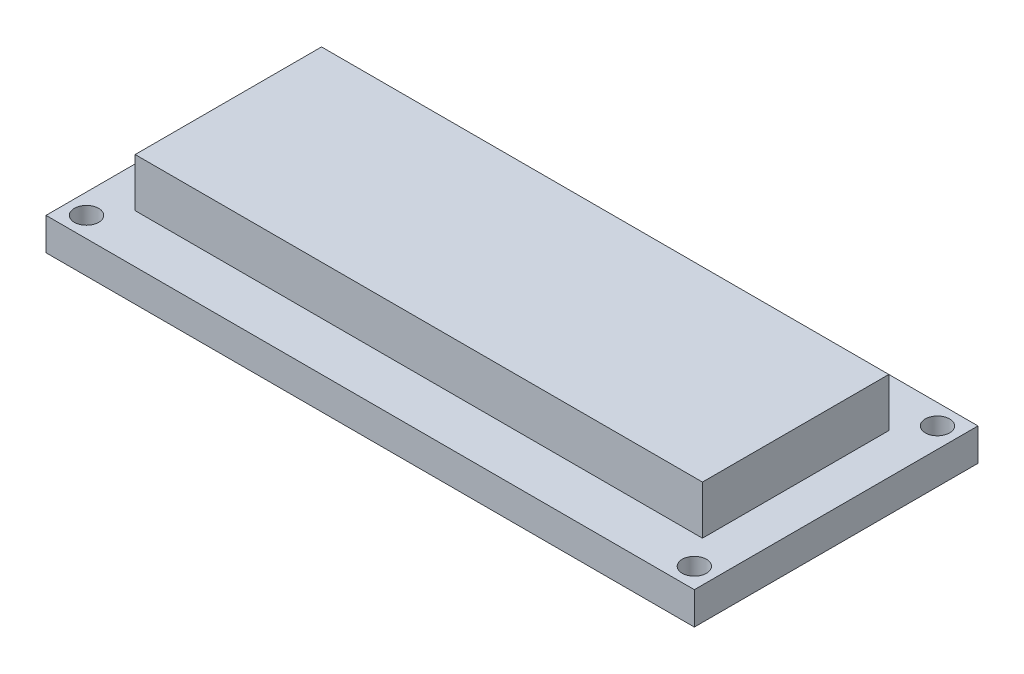
ISO-10303-21;
HEADER;
FILE_DESCRIPTION(('STEP AP214'),'2;1');
FILE_NAME('part.step','',(''),(''),'','','');
FILE_SCHEMA(('AUTOMOTIVE_DESIGN { 1 0 10303 214 1 1 1 1 }'));
ENDSEC;
DATA;
#1=APPLICATION_CONTEXT('core data for automotive mechanical design processes');
#2=APPLICATION_PROTOCOL_DEFINITION('international standard','automotive_design',2000,#1);
#3=PRODUCT_CONTEXT('',#1,'mechanical');
#4=PRODUCT('Part','Part','',(#3));
#5=PRODUCT_RELATED_PRODUCT_CATEGORY('part','',(#4));
#6=PRODUCT_DEFINITION_FORMATION('','',#4);
#7=PRODUCT_DEFINITION_CONTEXT('part definition',#1,'design');
#8=PRODUCT_DEFINITION('design','',#6,#7);
#9=PRODUCT_DEFINITION_SHAPE('','',#8);
#10=(LENGTH_UNIT() NAMED_UNIT(*) SI_UNIT(.MILLI.,.METRE.));
#11=(NAMED_UNIT(*) PLANE_ANGLE_UNIT() SI_UNIT($,.RADIAN.));
#12=(NAMED_UNIT(*) SI_UNIT($,.STERADIAN.) SOLID_ANGLE_UNIT());
#13=UNCERTAINTY_MEASURE_WITH_UNIT(LENGTH_MEASURE(1.E-05),#10,'distance_accuracy_value','');
#14=(GEOMETRIC_REPRESENTATION_CONTEXT(3) GLOBAL_UNCERTAINTY_ASSIGNED_CONTEXT((#13)) GLOBAL_UNIT_ASSIGNED_CONTEXT((#10,
#11,#12)) REPRESENTATION_CONTEXT('',''));
#15=CARTESIAN_POINT('',(0.,0.,0.));
#16=DIRECTION('',(0.,0.,1.));
#17=DIRECTION('',(1.,0.,0.));
#18=AXIS2_PLACEMENT_3D('',#15,#16,#17);
#19=CARTESIAN_POINT('',(0.,4.,0.));
#20=DIRECTION('',(0.,1.,0.));
#21=DIRECTION('',(0.,0.,1.));
#22=AXIS2_PLACEMENT_3D('',#19,#20,#21);
#23=PLANE('',#22);
#24=DIRECTION('',(0.,0.,1.));
#25=VECTOR('',#24,1.);
#26=CARTESIAN_POINT('',(-35.,4.,11.5));
#27=LINE('',#26,#25);
#28=CARTESIAN_POINT('',(-35.,4.,-11.5));
#29=VERTEX_POINT('',#28);
#30=CARTESIAN_POINT('',(-35.,4.,11.5));
#31=VERTEX_POINT('',#30);
#32=EDGE_CURVE('E52',#29,#31,#27,.T.);
#33=ORIENTED_EDGE('',*,*,#32,.F.);
#34=DIRECTION('',(-1.,0.,0.));
#35=VECTOR('',#34,1.);
#36=CARTESIAN_POINT('',(35.,4.,-11.5));
#37=LINE('',#36,#35);
#38=CARTESIAN_POINT('',(35.,4.,-11.5));
#39=VERTEX_POINT('',#38);
#40=EDGE_CURVE('E56',#39,#29,#37,.T.);
#41=ORIENTED_EDGE('',*,*,#40,.F.);
#42=DIRECTION('',(0.,0.,-1.));
#43=VECTOR('',#42,1.);
#44=CARTESIAN_POINT('',(35.,4.,11.5));
#45=LINE('',#44,#43);
#46=CARTESIAN_POINT('',(35.,4.,11.5));
#47=VERTEX_POINT('',#46);
#48=EDGE_CURVE('E343',#47,#39,#45,.T.);
#49=ORIENTED_EDGE('',*,*,#48,.F.);
#50=DIRECTION('',(1.,0.,0.));
#51=VECTOR('',#50,1.);
#52=CARTESIAN_POINT('',(35.,4.,11.5));
#53=LINE('',#52,#51);
#54=EDGE_CURVE('E349',#31,#47,#53,.T.);
#55=ORIENTED_EDGE('',*,*,#54,.F.);
#56=EDGE_LOOP('',(#33,#41,#49,#55));
#57=FACE_BOUND('',#56,.T.);
#58=CARTESIAN_POINT('',(37.5,4.,15.));
#59=DIRECTION('',(0.,1.,0.));
#60=DIRECTION('',(0.,0.,1.));
#61=AXIS2_PLACEMENT_3D('',#58,#59,#60);
#62=CIRCLE('',#61,1.5);
#63=CARTESIAN_POINT('',(37.5,4.,16.5));
#64=VERTEX_POINT('',#63);
#65=EDGE_CURVE('E134',#64,#64,#62,.T.);
#66=ORIENTED_EDGE('',*,*,#65,.F.);
#67=EDGE_LOOP('',(#66));
#68=FACE_BOUND('',#67,.T.);
#69=CARTESIAN_POINT('',(-37.5,4.,-15.));
#70=DIRECTION('',(0.,1.,0.));
#71=DIRECTION('',(0.,0.,1.));
#72=AXIS2_PLACEMENT_3D('',#69,#70,#71);
#73=CIRCLE('',#72,1.5);
#74=CARTESIAN_POINT('',(-37.5,4.,-13.5));
#75=VERTEX_POINT('',#74);
#76=EDGE_CURVE('E146',#75,#75,#73,.T.);
#77=ORIENTED_EDGE('',*,*,#76,.F.);
#78=EDGE_LOOP('',(#77));
#79=FACE_BOUND('',#78,.T.);
#80=DIRECTION('',(0.,0.,1.));
#81=VECTOR('',#80,1.);
#82=CARTESIAN_POINT('',(-40.,4.,17.5));
#83=LINE('',#82,#81);
#84=CARTESIAN_POINT('',(-40.,4.,-17.5));
#85=VERTEX_POINT('',#84);
#86=CARTESIAN_POINT('',(-40.,4.,17.5));
#87=VERTEX_POINT('',#86);
#88=EDGE_CURVE('E152',#85,#87,#83,.T.);
#89=ORIENTED_EDGE('',*,*,#88,.T.);
#90=DIRECTION('',(1.,0.,0.));
#91=VECTOR('',#90,1.);
#92=CARTESIAN_POINT('',(40.,4.,17.5));
#93=LINE('',#92,#91);
#94=CARTESIAN_POINT('',(40.,4.,17.5));
#95=VERTEX_POINT('',#94);
#96=EDGE_CURVE('E155',#87,#95,#93,.T.);
#97=ORIENTED_EDGE('',*,*,#96,.T.);
#98=DIRECTION('',(0.,0.,-1.));
#99=VECTOR('',#98,1.);
#100=CARTESIAN_POINT('',(40.,4.,17.5));
#101=LINE('',#100,#99);
#102=CARTESIAN_POINT('',(40.,4.,-17.5));
#103=VERTEX_POINT('',#102);
#104=EDGE_CURVE('E158',#95,#103,#101,.T.);
#105=ORIENTED_EDGE('',*,*,#104,.T.);
#106=DIRECTION('',(-1.,0.,0.));
#107=VECTOR('',#106,1.);
#108=CARTESIAN_POINT('',(40.,4.,-17.5));
#109=LINE('',#108,#107);
#110=EDGE_CURVE('E160',#103,#85,#109,.T.);
#111=ORIENTED_EDGE('',*,*,#110,.T.);
#112=EDGE_LOOP('',(#89,#97,#105,#111));
#113=FACE_BOUND('',#112,.T.);
#114=CARTESIAN_POINT('',(-37.5,4.,15.));
#115=DIRECTION('',(0.,1.,0.));
#116=DIRECTION('',(0.,0.,-1.));
#117=AXIS2_PLACEMENT_3D('',#114,#115,#116);
#118=CIRCLE('',#117,1.5);
#119=CARTESIAN_POINT('',(-37.5,4.,13.5));
#120=VERTEX_POINT('',#119);
#121=EDGE_CURVE('E140',#120,#120,#118,.T.);
#122=ORIENTED_EDGE('',*,*,#121,.F.);
#123=EDGE_LOOP('',(#122));
#124=FACE_BOUND('',#123,.T.);
#125=CARTESIAN_POINT('',(37.5,4.,-15.));
#126=DIRECTION('',(0.,1.,0.));
#127=DIRECTION('',(0.,0.,-1.));
#128=AXIS2_PLACEMENT_3D('',#125,#126,#127);
#129=CIRCLE('',#128,1.5);
#130=CARTESIAN_POINT('',(37.5,4.,-16.5));
#131=VERTEX_POINT('',#130);
#132=EDGE_CURVE('E125',#131,#131,#129,.T.);
#133=ORIENTED_EDGE('',*,*,#132,.F.);
#134=EDGE_LOOP('',(#133));
#135=FACE_BOUND('',#134,.T.);
#136=ADVANCED_FACE('F37',(#57,#68,#79,#113,#124,#135),#23,.T.);
#137=CARTESIAN_POINT('',(0.,0.,0.));
#138=DIRECTION('',(0.,1.,0.));
#139=DIRECTION('',(0.,0.,1.));
#140=AXIS2_PLACEMENT_3D('',#137,#138,#139);
#141=PLANE('',#140);
#142=DIRECTION('',(0.,0.,1.));
#143=VECTOR('',#142,1.);
#144=CARTESIAN_POINT('',(-40.,0.,17.5));
#145=LINE('',#144,#143);
#146=CARTESIAN_POINT('',(-40.,0.,-17.5));
#147=VERTEX_POINT('',#146);
#148=CARTESIAN_POINT('',(-40.,0.,17.5));
#149=VERTEX_POINT('',#148);
#150=EDGE_CURVE('E149',#147,#149,#145,.T.);
#151=ORIENTED_EDGE('',*,*,#150,.F.);
#152=DIRECTION('',(-1.,0.,0.));
#153=VECTOR('',#152,1.);
#154=CARTESIAN_POINT('',(40.,0.,-17.5));
#155=LINE('',#154,#153);
#156=CARTESIAN_POINT('',(40.,0.,-17.5));
#157=VERTEX_POINT('',#156);
#158=EDGE_CURVE('E156',#157,#147,#155,.T.);
#159=ORIENTED_EDGE('',*,*,#158,.F.);
#160=DIRECTION('',(0.,0.,-1.));
#161=VECTOR('',#160,1.);
#162=CARTESIAN_POINT('',(40.,0.,17.5));
#163=LINE('',#162,#161);
#164=CARTESIAN_POINT('',(40.,0.,17.5));
#165=VERTEX_POINT('',#164);
#166=EDGE_CURVE('E167',#165,#157,#163,.T.);
#167=ORIENTED_EDGE('',*,*,#166,.F.);
#168=DIRECTION('',(1.,0.,0.));
#169=VECTOR('',#168,1.);
#170=CARTESIAN_POINT('',(40.,0.,17.5));
#171=LINE('',#170,#169);
#172=EDGE_CURVE('E165',#149,#165,#171,.T.);
#173=ORIENTED_EDGE('',*,*,#172,.F.);
#174=EDGE_LOOP('',(#151,#159,#167,#173));
#175=FACE_BOUND('',#174,.T.);
#176=CARTESIAN_POINT('',(-37.5,0.,-15.));
#177=DIRECTION('',(0.,1.,0.));
#178=DIRECTION('',(0.,0.,1.));
#179=AXIS2_PLACEMENT_3D('',#176,#177,#178);
#180=CIRCLE('',#179,1.5);
#181=CARTESIAN_POINT('',(-37.5,0.,-13.5));
#182=VERTEX_POINT('',#181);
#183=EDGE_CURVE('E143',#182,#182,#180,.T.);
#184=ORIENTED_EDGE('',*,*,#183,.T.);
#185=EDGE_LOOP('',(#184));
#186=FACE_BOUND('',#185,.T.);
#187=CARTESIAN_POINT('',(-37.5,0.,15.));
#188=DIRECTION('',(0.,1.,0.));
#189=DIRECTION('',(0.,0.,-1.));
#190=AXIS2_PLACEMENT_3D('',#187,#188,#189);
#191=CIRCLE('',#190,1.5);
#192=CARTESIAN_POINT('',(-37.5,0.,13.5));
#193=VERTEX_POINT('',#192);
#194=EDGE_CURVE('E137',#193,#193,#191,.T.);
#195=ORIENTED_EDGE('',*,*,#194,.T.);
#196=EDGE_LOOP('',(#195));
#197=FACE_BOUND('',#196,.T.);
#198=CARTESIAN_POINT('',(37.5,0.,15.));
#199=DIRECTION('',(0.,1.,0.));
#200=DIRECTION('',(0.,0.,1.));
#201=AXIS2_PLACEMENT_3D('',#198,#199,#200);
#202=CIRCLE('',#201,1.5);
#203=CARTESIAN_POINT('',(37.5,0.,16.5));
#204=VERTEX_POINT('',#203);
#205=EDGE_CURVE('E132',#204,#204,#202,.T.);
#206=ORIENTED_EDGE('',*,*,#205,.T.);
#207=EDGE_LOOP('',(#206));
#208=FACE_BOUND('',#207,.T.);
#209=CARTESIAN_POINT('',(37.5,0.,-15.));
#210=DIRECTION('',(0.,1.,0.));
#211=DIRECTION('',(0.,0.,-1.));
#212=AXIS2_PLACEMENT_3D('',#209,#210,#211);
#213=CIRCLE('',#212,1.5);
#214=CARTESIAN_POINT('',(37.5,0.,-16.5));
#215=VERTEX_POINT('',#214);
#216=EDGE_CURVE('E122',#215,#215,#213,.T.);
#217=ORIENTED_EDGE('',*,*,#216,.T.);
#218=EDGE_LOOP('',(#217));
#219=FACE_BOUND('',#218,.T.);
#220=ADVANCED_FACE('F185',(#175,#186,#197,#208,#219),#141,.F.);
#221=CARTESIAN_POINT('',(-40.,4.,17.5));
#222=DIRECTION('',(1.,0.,0.));
#223=DIRECTION('',(0.,0.,-1.));
#224=AXIS2_PLACEMENT_3D('',#221,#222,#223);
#225=PLANE('',#224);
#226=ORIENTED_EDGE('',*,*,#150,.T.);
#227=DIRECTION('',(0.,-1.,0.));
#228=VECTOR('',#227,1.);
#229=CARTESIAN_POINT('',(-40.,4.,17.5));
#230=LINE('',#229,#228);
#231=EDGE_CURVE('E11',#87,#149,#230,.T.);
#232=ORIENTED_EDGE('',*,*,#231,.F.);
#233=ORIENTED_EDGE('',*,*,#88,.F.);
#234=DIRECTION('',(0.,-1.,0.));
#235=VECTOR('',#234,1.);
#236=CARTESIAN_POINT('',(-40.,4.,-17.5));
#237=LINE('',#236,#235);
#238=EDGE_CURVE('E162',#85,#147,#237,.T.);
#239=ORIENTED_EDGE('',*,*,#238,.T.);
#240=EDGE_LOOP('',(#226,#232,#233,#239));
#241=FACE_BOUND('',#240,.T.);
#242=ADVANCED_FACE('F39',(#241),#225,.F.);
#243=CARTESIAN_POINT('',(40.,4.,17.5));
#244=DIRECTION('',(0.,0.,-1.));
#245=DIRECTION('',(-1.,0.,0.));
#246=AXIS2_PLACEMENT_3D('',#243,#244,#245);
#247=PLANE('',#246);
#248=ORIENTED_EDGE('',*,*,#172,.T.);
#249=DIRECTION('',(0.,-1.,0.));
#250=VECTOR('',#249,1.);
#251=CARTESIAN_POINT('',(40.,4.,17.5));
#252=LINE('',#251,#250);
#253=EDGE_CURVE('E45',#95,#165,#252,.T.);
#254=ORIENTED_EDGE('',*,*,#253,.F.);
#255=ORIENTED_EDGE('',*,*,#96,.F.);
#256=ORIENTED_EDGE('',*,*,#231,.T.);
#257=EDGE_LOOP('',(#248,#254,#255,#256));
#258=FACE_BOUND('',#257,.T.);
#259=ADVANCED_FACE('F196',(#258),#247,.F.);
#260=CARTESIAN_POINT('',(40.,4.,17.5));
#261=DIRECTION('',(-1.,0.,0.));
#262=DIRECTION('',(0.,0.,1.));
#263=AXIS2_PLACEMENT_3D('',#260,#261,#262);
#264=PLANE('',#263);
#265=ORIENTED_EDGE('',*,*,#166,.T.);
#266=DIRECTION('',(0.,-1.,0.));
#267=VECTOR('',#266,1.);
#268=CARTESIAN_POINT('',(40.,4.,-17.5));
#269=LINE('',#268,#267);
#270=EDGE_CURVE('E172',#103,#157,#269,.T.);
#271=ORIENTED_EDGE('',*,*,#270,.F.);
#272=ORIENTED_EDGE('',*,*,#104,.F.);
#273=ORIENTED_EDGE('',*,*,#253,.T.);
#274=EDGE_LOOP('',(#265,#271,#272,#273));
#275=FACE_BOUND('',#274,.T.);
#276=ADVANCED_FACE('F179',(#275),#264,.F.);
#277=CARTESIAN_POINT('',(40.,4.,-17.5));
#278=DIRECTION('',(0.,0.,1.));
#279=DIRECTION('',(1.,0.,0.));
#280=AXIS2_PLACEMENT_3D('',#277,#278,#279);
#281=PLANE('',#280);
#282=ORIENTED_EDGE('',*,*,#158,.T.);
#283=ORIENTED_EDGE('',*,*,#238,.F.);
#284=ORIENTED_EDGE('',*,*,#110,.F.);
#285=ORIENTED_EDGE('',*,*,#270,.T.);
#286=EDGE_LOOP('',(#282,#283,#284,#285));
#287=FACE_BOUND('',#286,.T.);
#288=ADVANCED_FACE('F189',(#287),#281,.F.);
#289=CARTESIAN_POINT('',(-37.5,4.,-15.));
#290=DIRECTION('',(0.,-1.,0.));
#291=DIRECTION('',(0.,0.,-1.));
#292=AXIS2_PLACEMENT_3D('',#289,#290,#291);
#293=CYLINDRICAL_SURFACE('',#292,1.5);
#294=ORIENTED_EDGE('',*,*,#76,.T.);
#295=EDGE_LOOP('',(#294));
#296=FACE_BOUND('',#295,.T.);
#297=ORIENTED_EDGE('',*,*,#183,.F.);
#298=EDGE_LOOP('',(#297));
#299=FACE_BOUND('',#298,.T.);
#300=ADVANCED_FACE('F211',(#296,#299),#293,.F.);
#301=CARTESIAN_POINT('',(-37.5,4.,15.));
#302=DIRECTION('',(0.,-1.,0.));
#303=DIRECTION('',(0.,0.,-1.));
#304=AXIS2_PLACEMENT_3D('',#301,#302,#303);
#305=CYLINDRICAL_SURFACE('',#304,1.5);
#306=ORIENTED_EDGE('',*,*,#121,.T.);
#307=EDGE_LOOP('',(#306));
#308=FACE_BOUND('',#307,.T.);
#309=ORIENTED_EDGE('',*,*,#194,.F.);
#310=EDGE_LOOP('',(#309));
#311=FACE_BOUND('',#310,.T.);
#312=ADVANCED_FACE('F218',(#308,#311),#305,.F.);
#313=CARTESIAN_POINT('',(37.5,4.,15.));
#314=DIRECTION('',(0.,-1.,0.));
#315=DIRECTION('',(0.,0.,-1.));
#316=AXIS2_PLACEMENT_3D('',#313,#314,#315);
#317=CYLINDRICAL_SURFACE('',#316,1.5);
#318=ORIENTED_EDGE('',*,*,#65,.T.);
#319=EDGE_LOOP('',(#318));
#320=FACE_BOUND('',#319,.T.);
#321=ORIENTED_EDGE('',*,*,#205,.F.);
#322=EDGE_LOOP('',(#321));
#323=FACE_BOUND('',#322,.T.);
#324=ADVANCED_FACE('F223',(#320,#323),#317,.F.);
#325=CARTESIAN_POINT('',(37.5,4.,-15.));
#326=DIRECTION('',(0.,-1.,0.));
#327=DIRECTION('',(0.,0.,-1.));
#328=AXIS2_PLACEMENT_3D('',#325,#326,#327);
#329=CYLINDRICAL_SURFACE('',#328,1.5);
#330=ORIENTED_EDGE('',*,*,#132,.T.);
#331=EDGE_LOOP('',(#330));
#332=FACE_BOUND('',#331,.T.);
#333=ORIENTED_EDGE('',*,*,#216,.F.);
#334=EDGE_LOOP('',(#333));
#335=FACE_BOUND('',#334,.T.);
#336=ADVANCED_FACE('F235',(#332,#335),#329,.F.);
#337=CARTESIAN_POINT('',(-35.,10.,11.5));
#338=DIRECTION('',(1.,0.,0.));
#339=DIRECTION('',(0.,0.,-1.));
#340=AXIS2_PLACEMENT_3D('',#337,#338,#339);
#341=PLANE('',#340);
#342=ORIENTED_EDGE('',*,*,#32,.T.);
#343=DIRECTION('',(0.,-1.,0.));
#344=VECTOR('',#343,1.);
#345=CARTESIAN_POINT('',(-35.,10.,11.5));
#346=LINE('',#345,#344);
#347=CARTESIAN_POINT('',(-35.,10.,11.5));
#348=VERTEX_POINT('',#347);
#349=EDGE_CURVE('E105',#348,#31,#346,.T.);
#350=ORIENTED_EDGE('',*,*,#349,.F.);
#351=DIRECTION('',(0.,0.,1.));
#352=VECTOR('',#351,1.);
#353=CARTESIAN_POINT('',(-35.,10.,11.5));
#354=LINE('',#353,#352);
#355=CARTESIAN_POINT('',(-35.,10.,-11.5));
#356=VERTEX_POINT('',#355);
#357=EDGE_CURVE('E111',#356,#348,#354,.T.);
#358=ORIENTED_EDGE('',*,*,#357,.F.);
#359=DIRECTION('',(0.,-1.,0.));
#360=VECTOR('',#359,1.);
#361=CARTESIAN_POINT('',(-35.,10.,-11.5));
#362=LINE('',#361,#360);
#363=EDGE_CURVE('E341',#356,#29,#362,.T.);
#364=ORIENTED_EDGE('',*,*,#363,.T.);
#365=EDGE_LOOP('',(#342,#350,#358,#364));
#366=FACE_BOUND('',#365,.T.);
#367=ADVANCED_FACE('F121',(#366),#341,.F.);
#368=CARTESIAN_POINT('',(35.,10.,11.5));
#369=DIRECTION('',(0.,0.,-1.));
#370=DIRECTION('',(-1.,0.,0.));
#371=AXIS2_PLACEMENT_3D('',#368,#369,#370);
#372=PLANE('',#371);
#373=ORIENTED_EDGE('',*,*,#54,.T.);
#374=DIRECTION('',(0.,-1.,0.));
#375=VECTOR('',#374,1.);
#376=CARTESIAN_POINT('',(35.,10.,11.5));
#377=LINE('',#376,#375);
#378=CARTESIAN_POINT('',(35.,10.,11.5));
#379=VERTEX_POINT('',#378);
#380=EDGE_CURVE('E107',#379,#47,#377,.T.);
#381=ORIENTED_EDGE('',*,*,#380,.F.);
#382=DIRECTION('',(1.,0.,0.));
#383=VECTOR('',#382,1.);
#384=CARTESIAN_POINT('',(35.,10.,11.5));
#385=LINE('',#384,#383);
#386=EDGE_CURVE('E100',#348,#379,#385,.T.);
#387=ORIENTED_EDGE('',*,*,#386,.F.);
#388=ORIENTED_EDGE('',*,*,#349,.T.);
#389=EDGE_LOOP('',(#373,#381,#387,#388));
#390=FACE_BOUND('',#389,.T.);
#391=ADVANCED_FACE('F103',(#390),#372,.F.);
#392=CARTESIAN_POINT('',(35.,10.,11.5));
#393=DIRECTION('',(-1.,0.,0.));
#394=DIRECTION('',(0.,0.,1.));
#395=AXIS2_PLACEMENT_3D('',#392,#393,#394);
#396=PLANE('',#395);
#397=ORIENTED_EDGE('',*,*,#48,.T.);
#398=DIRECTION('',(0.,-1.,0.));
#399=VECTOR('',#398,1.);
#400=CARTESIAN_POINT('',(35.,10.,-11.5));
#401=LINE('',#400,#399);
#402=CARTESIAN_POINT('',(35.,10.,-11.5));
#403=VERTEX_POINT('',#402);
#404=EDGE_CURVE('E127',#403,#39,#401,.T.);
#405=ORIENTED_EDGE('',*,*,#404,.F.);
#406=DIRECTION('',(0.,0.,-1.));
#407=VECTOR('',#406,1.);
#408=CARTESIAN_POINT('',(35.,10.,11.5));
#409=LINE('',#408,#407);
#410=EDGE_CURVE('E110',#379,#403,#409,.T.);
#411=ORIENTED_EDGE('',*,*,#410,.F.);
#412=ORIENTED_EDGE('',*,*,#380,.T.);
#413=EDGE_LOOP('',(#397,#405,#411,#412));
#414=FACE_BOUND('',#413,.T.);
#415=ADVANCED_FACE('F249',(#414),#396,.F.);
#416=CARTESIAN_POINT('',(35.,10.,-11.5));
#417=DIRECTION('',(0.,0.,1.));
#418=DIRECTION('',(1.,0.,0.));
#419=AXIS2_PLACEMENT_3D('',#416,#417,#418);
#420=PLANE('',#419);
#421=ORIENTED_EDGE('',*,*,#40,.T.);
#422=ORIENTED_EDGE('',*,*,#363,.F.);
#423=DIRECTION('',(-1.,0.,0.));
#424=VECTOR('',#423,1.);
#425=CARTESIAN_POINT('',(35.,10.,-11.5));
#426=LINE('',#425,#424);
#427=EDGE_CURVE('E116',#403,#356,#426,.T.);
#428=ORIENTED_EDGE('',*,*,#427,.F.);
#429=ORIENTED_EDGE('',*,*,#404,.T.);
#430=EDGE_LOOP('',(#421,#422,#428,#429));
#431=FACE_BOUND('',#430,.T.);
#432=ADVANCED_FACE('F252',(#431),#420,.F.);
#433=CARTESIAN_POINT('',(0.,10.,0.));
#434=DIRECTION('',(0.,1.,0.));
#435=DIRECTION('',(0.,0.,1.));
#436=AXIS2_PLACEMENT_3D('',#433,#434,#435);
#437=PLANE('',#436);
#438=ORIENTED_EDGE('',*,*,#357,.T.);
#439=ORIENTED_EDGE('',*,*,#386,.T.);
#440=ORIENTED_EDGE('',*,*,#410,.T.);
#441=ORIENTED_EDGE('',*,*,#427,.T.);
#442=EDGE_LOOP('',(#438,#439,#440,#441));
#443=FACE_BOUND('',#442,.T.);
#444=ADVANCED_FACE('F114',(#443),#437,.T.);
#445=CLOSED_SHELL('',(#136,#220,#242,#259,#276,#288,#300,#312,#324,#336,#367,#391,#415,#432,#444));
#446=MANIFOLD_SOLID_BREP('B2',#445);
#447=ADVANCED_BREP_SHAPE_REPRESENTATION('',(#18,#446),#14);
#448=SHAPE_DEFINITION_REPRESENTATION(#9,#447);
ENDSEC;
END-ISO-10303-21;
